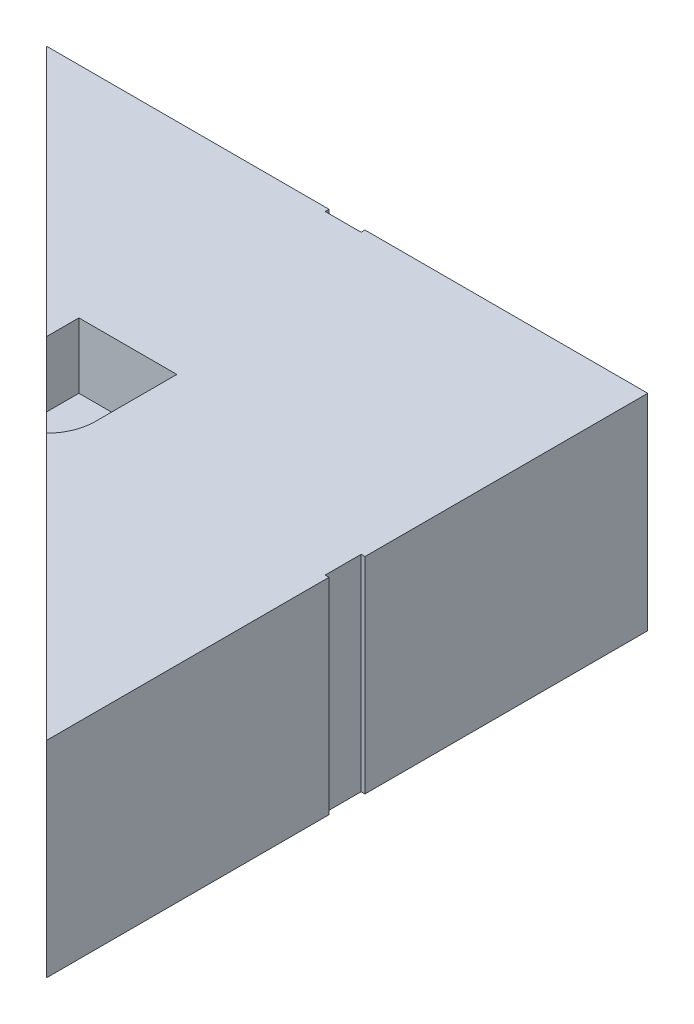
ISO-10303-21;
HEADER;
FILE_DESCRIPTION(('STEP AP214'),'2;1');
FILE_NAME('part.step','',(''),(''),'','','');
FILE_SCHEMA(('AUTOMOTIVE_DESIGN { 1 0 10303 214 1 1 1 1 }'));
ENDSEC;
DATA;
#1=APPLICATION_CONTEXT('core data for automotive mechanical design processes');
#2=APPLICATION_PROTOCOL_DEFINITION('international standard','automotive_design',2000,#1);
#3=PRODUCT_CONTEXT('',#1,'mechanical');
#4=PRODUCT('Part','Part','',(#3));
#5=PRODUCT_RELATED_PRODUCT_CATEGORY('part','',(#4));
#6=PRODUCT_DEFINITION_FORMATION('','',#4);
#7=PRODUCT_DEFINITION_CONTEXT('part definition',#1,'design');
#8=PRODUCT_DEFINITION('design','',#6,#7);
#9=PRODUCT_DEFINITION_SHAPE('','',#8);
#10=(LENGTH_UNIT() NAMED_UNIT(*) SI_UNIT(.MILLI.,.METRE.));
#11=(NAMED_UNIT(*) PLANE_ANGLE_UNIT() SI_UNIT($,.RADIAN.));
#12=(NAMED_UNIT(*) SI_UNIT($,.STERADIAN.) SOLID_ANGLE_UNIT());
#13=UNCERTAINTY_MEASURE_WITH_UNIT(LENGTH_MEASURE(1.E-05),#10,'distance_accuracy_value','');
#14=(GEOMETRIC_REPRESENTATION_CONTEXT(3) GLOBAL_UNCERTAINTY_ASSIGNED_CONTEXT((#13)) GLOBAL_UNIT_ASSIGNED_CONTEXT((#10,
#11,#12)) REPRESENTATION_CONTEXT('',''));
#15=CARTESIAN_POINT('',(0.,0.,0.));
#16=DIRECTION('',(0.,0.,1.));
#17=DIRECTION('',(1.,0.,0.));
#18=AXIS2_PLACEMENT_3D('',#15,#16,#17);
#19=CARTESIAN_POINT('',(117.,40.,0.));
#20=DIRECTION('',(-1.,0.,0.));
#21=DIRECTION('',(0.,0.,1.));
#22=AXIS2_PLACEMENT_3D('',#19,#20,#21);
#23=PLANE('',#22);
#24=DIRECTION('',(0.,0.,-1.));
#25=VECTOR('',#24,1.);
#26=CARTESIAN_POINT('',(117.,0.,0.));
#27=LINE('',#26,#25);
#28=CARTESIAN_POINT('',(117.,0.,0.));
#29=VERTEX_POINT('',#28);
#30=CARTESIAN_POINT('',(117.,0.,-54.9999999999998));
#31=VERTEX_POINT('',#30);
#32=EDGE_CURVE('E269',#29,#31,#27,.T.);
#33=ORIENTED_EDGE('',*,*,#32,.T.);
#34=DIRECTION('',(0.,1.,0.));
#35=VECTOR('',#34,1.);
#36=CARTESIAN_POINT('',(117.,40.,-54.9999999999998));
#37=LINE('',#36,#35);
#38=CARTESIAN_POINT('',(117.,40.,-54.9999999999998));
#39=VERTEX_POINT('',#38);
#40=EDGE_CURVE('E194',#31,#39,#37,.T.);
#41=ORIENTED_EDGE('',*,*,#40,.T.);
#42=DIRECTION('',(0.,0.,-1.));
#43=VECTOR('',#42,1.);
#44=CARTESIAN_POINT('',(117.,40.,0.));
#45=LINE('',#44,#43);
#46=CARTESIAN_POINT('',(117.,40.,0.));
#47=VERTEX_POINT('',#46);
#48=EDGE_CURVE('E169',#47,#39,#45,.T.);
#49=ORIENTED_EDGE('',*,*,#48,.F.);
#50=DIRECTION('',(0.,-1.,0.));
#51=VECTOR('',#50,1.);
#52=CARTESIAN_POINT('',(117.,40.,0.));
#53=LINE('',#52,#51);
#54=EDGE_CURVE('E178',#47,#29,#53,.T.);
#55=ORIENTED_EDGE('',*,*,#54,.T.);
#56=EDGE_LOOP('',(#33,#41,#49,#55));
#57=FACE_BOUND('',#56,.T.);
#58=ADVANCED_FACE('F36',(#57),#23,.F.);
#59=CARTESIAN_POINT('',(0.,40.,-117.));
#60=DIRECTION('',(0.,0.,1.));
#61=DIRECTION('',(1.,0.,0.));
#62=AXIS2_PLACEMENT_3D('',#59,#60,#61);
#63=PLANE('',#62);
#64=DIRECTION('',(-1.,0.,0.));
#65=VECTOR('',#64,1.);
#66=CARTESIAN_POINT('',(0.,0.,-117.));
#67=LINE('',#66,#65);
#68=CARTESIAN_POINT('',(117.,0.,-117.));
#69=VERTEX_POINT('',#68);
#70=CARTESIAN_POINT('',(62.,0.,-117.));
#71=VERTEX_POINT('',#70);
#72=EDGE_CURVE('E182',#69,#71,#67,.T.);
#73=ORIENTED_EDGE('',*,*,#72,.T.);
#74=DIRECTION('',(0.,1.,0.));
#75=VECTOR('',#74,1.);
#76=CARTESIAN_POINT('',(62.,40.,-117.));
#77=LINE('',#76,#75);
#78=CARTESIAN_POINT('',(62.,40.,-117.));
#79=VERTEX_POINT('',#78);
#80=EDGE_CURVE('E235',#71,#79,#77,.T.);
#81=ORIENTED_EDGE('',*,*,#80,.T.);
#82=DIRECTION('',(-1.,0.,0.));
#83=VECTOR('',#82,1.);
#84=CARTESIAN_POINT('',(0.,40.,-117.));
#85=LINE('',#84,#83);
#86=CARTESIAN_POINT('',(117.,40.,-117.));
#87=VERTEX_POINT('',#86);
#88=EDGE_CURVE('E168',#87,#79,#85,.T.);
#89=ORIENTED_EDGE('',*,*,#88,.F.);
#90=DIRECTION('',(0.,-1.,0.));
#91=VECTOR('',#90,1.);
#92=CARTESIAN_POINT('',(117.,40.,-117.));
#93=LINE('',#92,#91);
#94=EDGE_CURVE('E175',#87,#69,#93,.T.);
#95=ORIENTED_EDGE('',*,*,#94,.T.);
#96=EDGE_LOOP('',(#73,#81,#89,#95));
#97=FACE_BOUND('',#96,.T.);
#98=ADVANCED_FACE('F278',(#97),#63,.F.);
#99=CARTESIAN_POINT('',(117.,40.,-61.9999999999998));
#100=VERTEX_POINT('',#99);
#101=EDGE_CURVE('E268',#100,#87,#45,.T.);
#102=ORIENTED_EDGE('',*,*,#101,.F.);
#103=DIRECTION('',(0.,-1.,0.));
#104=VECTOR('',#103,1.);
#105=CARTESIAN_POINT('',(117.,40.,-61.9999999999998));
#106=LINE('',#105,#104);
#107=CARTESIAN_POINT('',(117.,0.,-61.9999999999998));
#108=VERTEX_POINT('',#107);
#109=EDGE_CURVE('E213',#100,#108,#106,.T.);
#110=ORIENTED_EDGE('',*,*,#109,.T.);
#111=EDGE_CURVE('E262',#108,#69,#27,.T.);
#112=ORIENTED_EDGE('',*,*,#111,.T.);
#113=ORIENTED_EDGE('',*,*,#94,.F.);
#114=EDGE_LOOP('',(#102,#110,#112,#113));
#115=FACE_BOUND('',#114,.T.);
#116=ADVANCED_FACE('F38',(#115),#23,.F.);
#117=CARTESIAN_POINT('',(55.,40.,-117.));
#118=VERTEX_POINT('',#117);
#119=CARTESIAN_POINT('',(0.,40.,-117.));
#120=VERTEX_POINT('',#119);
#121=EDGE_CURVE('E161',#118,#120,#85,.T.);
#122=ORIENTED_EDGE('',*,*,#121,.F.);
#123=DIRECTION('',(0.,-1.,0.));
#124=VECTOR('',#123,1.);
#125=CARTESIAN_POINT('',(55.,40.,-117.));
#126=LINE('',#125,#124);
#127=CARTESIAN_POINT('',(55.,0.,-117.));
#128=VERTEX_POINT('',#127);
#129=EDGE_CURVE('E232',#118,#128,#126,.T.);
#130=ORIENTED_EDGE('',*,*,#129,.T.);
#131=CARTESIAN_POINT('',(0.,0.,-117.));
#132=VERTEX_POINT('',#131);
#133=EDGE_CURVE('E174',#128,#132,#67,.T.);
#134=ORIENTED_EDGE('',*,*,#133,.T.);
#135=DIRECTION('',(0.,-1.,0.));
#136=VECTOR('',#135,1.);
#137=CARTESIAN_POINT('',(0.,40.,-117.));
#138=LINE('',#137,#136);
#139=EDGE_CURVE('E151',#120,#132,#138,.T.);
#140=ORIENTED_EDGE('',*,*,#139,.F.);
#141=EDGE_LOOP('',(#122,#130,#134,#140));
#142=FACE_BOUND('',#141,.T.);
#143=ADVANCED_FACE('F172',(#142),#63,.F.);
#144=CARTESIAN_POINT('',(0.,40.,0.));
#145=DIRECTION('',(0.,-1.,0.));
#146=DIRECTION('',(0.,0.,-1.));
#147=AXIS2_PLACEMENT_3D('',#144,#145,#146);
#148=PLANE('',#147);
#149=ORIENTED_EDGE('',*,*,#121,.T.);
#150=DIRECTION('',(0.707106781186548,0.,0.707106781186548));
#151=VECTOR('',#150,1.);
#152=CARTESIAN_POINT('',(0.,40.,-117.));
#153=LINE('',#152,#151);
#154=CARTESIAN_POINT('',(48.975,40.,-68.025));
#155=VERTEX_POINT('',#154);
#156=EDGE_CURVE('E147',#120,#155,#153,.T.);
#157=ORIENTED_EDGE('',*,*,#156,.T.);
#158=DIRECTION('',(0.,0.,-1.));
#159=VECTOR('',#158,1.);
#160=CARTESIAN_POINT('',(48.975,40.,0.));
#161=LINE('',#160,#159);
#162=CARTESIAN_POINT('',(48.975,40.,-74.375));
#163=VERTEX_POINT('',#162);
#164=EDGE_CURVE('E242',#155,#163,#161,.T.);
#165=ORIENTED_EDGE('',*,*,#164,.T.);
#166=DIRECTION('',(-1.,0.,0.));
#167=VECTOR('',#166,1.);
#168=CARTESIAN_POINT('',(0.,40.,-74.3750000000001));
#169=LINE('',#168,#167);
#170=CARTESIAN_POINT('',(68.025,40.,-74.375));
#171=VERTEX_POINT('',#170);
#172=EDGE_CURVE('E255',#171,#163,#169,.T.);
#173=ORIENTED_EDGE('',*,*,#172,.F.);
#174=DIRECTION('',(0.,0.,-1.));
#175=VECTOR('',#174,1.);
#176=CARTESIAN_POINT('',(68.025,40.,0.));
#177=LINE('',#176,#175);
#178=CARTESIAN_POINT('',(68.025,40.,-58.5));
#179=VERTEX_POINT('',#178);
#180=EDGE_CURVE('E252',#179,#171,#177,.T.);
#181=ORIENTED_EDGE('',*,*,#180,.F.);
#182=CARTESIAN_POINT('',(58.5,40.,-58.5));
#183=DIRECTION('',(0.,1.,0.));
#184=DIRECTION('',(0.,0.,1.));
#185=AXIS2_PLACEMENT_3D('',#182,#183,#184);
#186=CIRCLE('',#185,9.52500000000002);
#187=CARTESIAN_POINT('',(65.2351920908019,40.,-51.7648079091981));
#188=VERTEX_POINT('',#187);
#189=EDGE_CURVE('E238',#188,#179,#186,.T.);
#190=ORIENTED_EDGE('',*,*,#189,.F.);
#191=EDGE_CURVE('E157',#188,#47,#153,.T.);
#192=ORIENTED_EDGE('',*,*,#191,.T.);
#193=ORIENTED_EDGE('',*,*,#48,.T.);
#194=DIRECTION('',(-1.,0.,0.));
#195=VECTOR('',#194,1.);
#196=CARTESIAN_POINT('',(116.25,40.,-54.9999999999998));
#197=LINE('',#196,#195);
#198=CARTESIAN_POINT('',(116.25,40.,-54.9999999999998));
#199=VERTEX_POINT('',#198);
#200=EDGE_CURVE('E204',#39,#199,#197,.T.);
#201=ORIENTED_EDGE('',*,*,#200,.T.);
#202=DIRECTION('',(0.,0.,-1.));
#203=VECTOR('',#202,1.);
#204=CARTESIAN_POINT('',(116.25,40.,-61.9999999999998));
#205=LINE('',#204,#203);
#206=CARTESIAN_POINT('',(116.25,40.,-61.9999999999998));
#207=VERTEX_POINT('',#206);
#208=EDGE_CURVE('E285',#199,#207,#205,.T.);
#209=ORIENTED_EDGE('',*,*,#208,.T.);
#210=DIRECTION('',(1.,0.,0.));
#211=VECTOR('',#210,1.);
#212=CARTESIAN_POINT('',(116.25,40.,-61.9999999999998));
#213=LINE('',#212,#211);
#214=EDGE_CURVE('E208',#207,#100,#213,.T.);
#215=ORIENTED_EDGE('',*,*,#214,.T.);
#216=ORIENTED_EDGE('',*,*,#101,.T.);
#217=ORIENTED_EDGE('',*,*,#88,.T.);
#218=DIRECTION('',(0.,0.,1.));
#219=VECTOR('',#218,1.);
#220=CARTESIAN_POINT('',(62.,40.,-116.25));
#221=LINE('',#220,#219);
#222=CARTESIAN_POINT('',(62.,40.,-116.25));
#223=VERTEX_POINT('',#222);
#224=EDGE_CURVE('E219',#79,#223,#221,.T.);
#225=ORIENTED_EDGE('',*,*,#224,.T.);
#226=DIRECTION('',(-1.,0.,0.));
#227=VECTOR('',#226,1.);
#228=CARTESIAN_POINT('',(55.,40.,-116.25));
#229=LINE('',#228,#227);
#230=CARTESIAN_POINT('',(55.,40.,-116.25));
#231=VERTEX_POINT('',#230);
#232=EDGE_CURVE('E222',#223,#231,#229,.T.);
#233=ORIENTED_EDGE('',*,*,#232,.T.);
#234=DIRECTION('',(0.,0.,-1.));
#235=VECTOR('',#234,1.);
#236=CARTESIAN_POINT('',(55.,40.,-116.25));
#237=LINE('',#236,#235);
#238=EDGE_CURVE('E165',#231,#118,#237,.T.);
#239=ORIENTED_EDGE('',*,*,#238,.T.);
#240=EDGE_LOOP('',(#149,#157,#165,#173,#181,#190,#192,#193,#201,#209,#215,#216,#217,#225,#233,#239));
#241=FACE_BOUND('',#240,.T.);
#242=ADVANCED_FACE('F162',(#241),#148,.F.);
#243=CARTESIAN_POINT('',(0.,0.,0.));
#244=DIRECTION('',(0.,-1.,0.));
#245=DIRECTION('',(0.,0.,-1.));
#246=AXIS2_PLACEMENT_3D('',#243,#244,#245);
#247=PLANE('',#246);
#248=DIRECTION('',(0.707106781186548,0.,0.707106781186548));
#249=VECTOR('',#248,1.);
#250=CARTESIAN_POINT('',(0.,0.,-117.));
#251=LINE('',#250,#249);
#252=EDGE_CURVE('E290',#132,#29,#251,.T.);
#253=ORIENTED_EDGE('',*,*,#252,.F.);
#254=ORIENTED_EDGE('',*,*,#133,.F.);
#255=DIRECTION('',(0.,0.,-1.));
#256=VECTOR('',#255,1.);
#257=CARTESIAN_POINT('',(55.,0.,-116.25));
#258=LINE('',#257,#256);
#259=CARTESIAN_POINT('',(55.,0.,-116.25));
#260=VERTEX_POINT('',#259);
#261=EDGE_CURVE('E223',#260,#128,#258,.T.);
#262=ORIENTED_EDGE('',*,*,#261,.F.);
#263=DIRECTION('',(-1.,0.,0.));
#264=VECTOR('',#263,1.);
#265=CARTESIAN_POINT('',(55.,0.,-116.25));
#266=LINE('',#265,#264);
#267=CARTESIAN_POINT('',(62.,0.,-116.25));
#268=VERTEX_POINT('',#267);
#269=EDGE_CURVE('E218',#268,#260,#266,.T.);
#270=ORIENTED_EDGE('',*,*,#269,.F.);
#271=DIRECTION('',(0.,0.,1.));
#272=VECTOR('',#271,1.);
#273=CARTESIAN_POINT('',(62.,0.,0.));
#274=LINE('',#273,#272);
#275=EDGE_CURVE('E187',#71,#268,#274,.T.);
#276=ORIENTED_EDGE('',*,*,#275,.F.);
#277=ORIENTED_EDGE('',*,*,#72,.F.);
#278=ORIENTED_EDGE('',*,*,#111,.F.);
#279=DIRECTION('',(1.,0.,0.));
#280=VECTOR('',#279,1.);
#281=CARTESIAN_POINT('',(116.25,0.,-61.9999999999998));
#282=LINE('',#281,#280);
#283=CARTESIAN_POINT('',(116.25,0.,-61.9999999999998));
#284=VERTEX_POINT('',#283);
#285=EDGE_CURVE('E202',#284,#108,#282,.T.);
#286=ORIENTED_EDGE('',*,*,#285,.F.);
#287=DIRECTION('',(0.,0.,-1.));
#288=VECTOR('',#287,1.);
#289=CARTESIAN_POINT('',(116.25,0.,-61.9999999999998));
#290=LINE('',#289,#288);
#291=CARTESIAN_POINT('',(116.25,0.,-54.9999999999998));
#292=VERTEX_POINT('',#291);
#293=EDGE_CURVE('E199',#292,#284,#290,.T.);
#294=ORIENTED_EDGE('',*,*,#293,.F.);
#295=DIRECTION('',(-1.,0.,0.));
#296=VECTOR('',#295,1.);
#297=CARTESIAN_POINT('',(1.92031473636373E-13,0.,-55.0000000000002));
#298=LINE('',#297,#296);
#299=EDGE_CURVE('E44',#31,#292,#298,.T.);
#300=ORIENTED_EDGE('',*,*,#299,.F.);
#301=ORIENTED_EDGE('',*,*,#32,.F.);
#302=EDGE_LOOP('',(#253,#254,#262,#270,#276,#277,#278,#286,#294,#300,#301));
#303=FACE_BOUND('',#302,.T.);
#304=ADVANCED_FACE('F200',(#303),#247,.T.);
#305=CARTESIAN_POINT('',(48.975,27.3,0.));
#306=DIRECTION('',(1.,0.,0.));
#307=DIRECTION('',(0.,0.,-1.));
#308=AXIS2_PLACEMENT_3D('',#305,#306,#307);
#309=PLANE('',#308);
#310=DIRECTION('',(0.,1.,0.));
#311=VECTOR('',#310,1.);
#312=CARTESIAN_POINT('',(48.975,27.3,-68.025));
#313=LINE('',#312,#311);
#314=CARTESIAN_POINT('',(48.975,27.3,-68.025));
#315=VERTEX_POINT('',#314);
#316=EDGE_CURVE('E154',#315,#155,#313,.T.);
#317=ORIENTED_EDGE('',*,*,#316,.F.);
#318=DIRECTION('',(0.,0.,-1.));
#319=VECTOR('',#318,1.);
#320=CARTESIAN_POINT('',(48.975,27.3,0.));
#321=LINE('',#320,#319);
#322=CARTESIAN_POINT('',(48.975,27.3,-74.375));
#323=VERTEX_POINT('',#322);
#324=EDGE_CURVE('E248',#315,#323,#321,.T.);
#325=ORIENTED_EDGE('',*,*,#324,.T.);
#326=DIRECTION('',(0.,1.,0.));
#327=VECTOR('',#326,1.);
#328=CARTESIAN_POINT('',(48.975,27.3,-74.375));
#329=LINE('',#328,#327);
#330=EDGE_CURVE('E259',#323,#163,#329,.T.);
#331=ORIENTED_EDGE('',*,*,#330,.T.);
#332=ORIENTED_EDGE('',*,*,#164,.F.);
#333=EDGE_LOOP('',(#317,#325,#331,#332));
#334=FACE_BOUND('',#333,.T.);
#335=ADVANCED_FACE('F329',(#334),#309,.T.);
#336=CARTESIAN_POINT('',(0.,27.3,-74.3750000000001));
#337=DIRECTION('',(0.,0.,-1.));
#338=DIRECTION('',(-1.,0.,0.));
#339=AXIS2_PLACEMENT_3D('',#336,#337,#338);
#340=PLANE('',#339);
#341=ORIENTED_EDGE('',*,*,#172,.T.);
#342=ORIENTED_EDGE('',*,*,#330,.F.);
#343=DIRECTION('',(-1.,0.,0.));
#344=VECTOR('',#343,1.);
#345=CARTESIAN_POINT('',(0.,27.3,-74.3750000000001));
#346=LINE('',#345,#344);
#347=CARTESIAN_POINT('',(68.025,27.3,-74.375));
#348=VERTEX_POINT('',#347);
#349=EDGE_CURVE('E245',#348,#323,#346,.T.);
#350=ORIENTED_EDGE('',*,*,#349,.F.);
#351=DIRECTION('',(0.,1.,0.));
#352=VECTOR('',#351,1.);
#353=CARTESIAN_POINT('',(68.025,27.3,-74.375));
#354=LINE('',#353,#352);
#355=EDGE_CURVE('E263',#348,#171,#354,.T.);
#356=ORIENTED_EDGE('',*,*,#355,.T.);
#357=EDGE_LOOP('',(#341,#342,#350,#356));
#358=FACE_BOUND('',#357,.T.);
#359=ADVANCED_FACE('F337',(#358),#340,.F.);
#360=CARTESIAN_POINT('',(68.025,27.3,0.));
#361=DIRECTION('',(1.,0.,0.));
#362=DIRECTION('',(0.,0.,-1.));
#363=AXIS2_PLACEMENT_3D('',#360,#361,#362);
#364=PLANE('',#363);
#365=ORIENTED_EDGE('',*,*,#180,.T.);
#366=ORIENTED_EDGE('',*,*,#355,.F.);
#367=DIRECTION('',(0.,0.,-1.));
#368=VECTOR('',#367,1.);
#369=CARTESIAN_POINT('',(68.025,27.3,0.));
#370=LINE('',#369,#368);
#371=CARTESIAN_POINT('',(68.025,27.3,-58.5));
#372=VERTEX_POINT('',#371);
#373=EDGE_CURVE('E241',#372,#348,#370,.T.);
#374=ORIENTED_EDGE('',*,*,#373,.F.);
#375=DIRECTION('',(0.,1.,0.));
#376=VECTOR('',#375,1.);
#377=CARTESIAN_POINT('',(68.025,27.3,-58.5));
#378=LINE('',#377,#376);
#379=EDGE_CURVE('E250',#372,#179,#378,.T.);
#380=ORIENTED_EDGE('',*,*,#379,.T.);
#381=EDGE_LOOP('',(#365,#366,#374,#380));
#382=FACE_BOUND('',#381,.T.);
#383=ADVANCED_FACE('F333',(#382),#364,.F.);
#384=CARTESIAN_POINT('',(58.5,27.3,-58.5));
#385=DIRECTION('',(0.,1.,0.));
#386=DIRECTION('',(0.,0.,1.));
#387=AXIS2_PLACEMENT_3D('',#384,#385,#386);
#388=CYLINDRICAL_SURFACE('',#387,9.52500000000002);
#389=CARTESIAN_POINT('',(58.5,27.3,-58.5));
#390=DIRECTION('',(0.,1.,0.));
#391=DIRECTION('',(0.,0.,1.));
#392=AXIS2_PLACEMENT_3D('',#389,#390,#391);
#393=CIRCLE('',#392,9.52500000000002);
#394=CARTESIAN_POINT('',(65.2351920908019,27.3,-51.7648079091981));
#395=VERTEX_POINT('',#394);
#396=EDGE_CURVE('E239',#395,#372,#393,.T.);
#397=ORIENTED_EDGE('',*,*,#396,.F.);
#398=DIRECTION('',(0.,1.,0.));
#399=VECTOR('',#398,1.);
#400=CARTESIAN_POINT('',(65.2351920908019,27.3,-51.7648079091981));
#401=LINE('',#400,#399);
#402=EDGE_CURVE('E50',#395,#188,#401,.T.);
#403=ORIENTED_EDGE('',*,*,#402,.T.);
#404=ORIENTED_EDGE('',*,*,#189,.T.);
#405=ORIENTED_EDGE('',*,*,#379,.F.);
#406=EDGE_LOOP('',(#397,#403,#404,#405));
#407=FACE_BOUND('',#406,.T.);
#408=ADVANCED_FACE('F311',(#407),#388,.F.);
#409=CARTESIAN_POINT('',(0.,27.3,0.));
#410=DIRECTION('',(0.,1.,0.));
#411=DIRECTION('',(0.,0.,1.));
#412=AXIS2_PLACEMENT_3D('',#409,#410,#411);
#413=PLANE('',#412);
#414=DIRECTION('',(-0.707106781186548,0.,-0.707106781186548));
#415=VECTOR('',#414,1.);
#416=CARTESIAN_POINT('',(58.5,27.3,-58.5));
#417=LINE('',#416,#415);
#418=EDGE_CURVE('E11',#395,#315,#417,.T.);
#419=ORIENTED_EDGE('',*,*,#418,.F.);
#420=ORIENTED_EDGE('',*,*,#396,.T.);
#421=ORIENTED_EDGE('',*,*,#373,.T.);
#422=ORIENTED_EDGE('',*,*,#349,.T.);
#423=ORIENTED_EDGE('',*,*,#324,.F.);
#424=EDGE_LOOP('',(#419,#420,#421,#422,#423));
#425=FACE_BOUND('',#424,.T.);
#426=ADVANCED_FACE('F304',(#425),#413,.T.);
#427=CARTESIAN_POINT('',(62.,40.,-116.25));
#428=DIRECTION('',(1.,0.,0.));
#429=DIRECTION('',(0.,0.,-1.));
#430=AXIS2_PLACEMENT_3D('',#427,#428,#429);
#431=PLANE('',#430);
#432=ORIENTED_EDGE('',*,*,#275,.T.);
#433=DIRECTION('',(0.,-1.,0.));
#434=VECTOR('',#433,1.);
#435=CARTESIAN_POINT('',(62.,40.,-116.25));
#436=LINE('',#435,#434);
#437=EDGE_CURVE('E226',#223,#268,#436,.T.);
#438=ORIENTED_EDGE('',*,*,#437,.F.);
#439=ORIENTED_EDGE('',*,*,#224,.F.);
#440=ORIENTED_EDGE('',*,*,#80,.F.);
#441=EDGE_LOOP('',(#432,#438,#439,#440));
#442=FACE_BOUND('',#441,.T.);
#443=ADVANCED_FACE('F302',(#442),#431,.F.);
#444=CARTESIAN_POINT('',(55.,40.,-116.25));
#445=DIRECTION('',(-1.,0.,0.));
#446=DIRECTION('',(0.,0.,1.));
#447=AXIS2_PLACEMENT_3D('',#444,#445,#446);
#448=PLANE('',#447);
#449=ORIENTED_EDGE('',*,*,#238,.F.);
#450=DIRECTION('',(0.,-1.,0.));
#451=VECTOR('',#450,1.);
#452=CARTESIAN_POINT('',(55.,40.,-116.25));
#453=LINE('',#452,#451);
#454=EDGE_CURVE('E230',#231,#260,#453,.T.);
#455=ORIENTED_EDGE('',*,*,#454,.T.);
#456=ORIENTED_EDGE('',*,*,#261,.T.);
#457=ORIENTED_EDGE('',*,*,#129,.F.);
#458=EDGE_LOOP('',(#449,#455,#456,#457));
#459=FACE_BOUND('',#458,.T.);
#460=ADVANCED_FACE('F297',(#459),#448,.F.);
#461=CARTESIAN_POINT('',(55.,40.,-116.25));
#462=DIRECTION('',(0.,0.,1.));
#463=DIRECTION('',(1.,0.,0.));
#464=AXIS2_PLACEMENT_3D('',#461,#462,#463);
#465=PLANE('',#464);
#466=ORIENTED_EDGE('',*,*,#269,.T.);
#467=ORIENTED_EDGE('',*,*,#454,.F.);
#468=ORIENTED_EDGE('',*,*,#232,.F.);
#469=ORIENTED_EDGE('',*,*,#437,.T.);
#470=EDGE_LOOP('',(#466,#467,#468,#469));
#471=FACE_BOUND('',#470,.T.);
#472=ADVANCED_FACE('F300',(#471),#465,.F.);
#473=CARTESIAN_POINT('',(116.25,40.,-54.9999999999998));
#474=DIRECTION('',(0.,0.,1.));
#475=DIRECTION('',(1.,0.,0.));
#476=AXIS2_PLACEMENT_3D('',#473,#474,#475);
#477=PLANE('',#476);
#478=ORIENTED_EDGE('',*,*,#299,.T.);
#479=DIRECTION('',(0.,-1.,0.));
#480=VECTOR('',#479,1.);
#481=CARTESIAN_POINT('',(116.25,40.,-54.9999999999998));
#482=LINE('',#481,#480);
#483=EDGE_CURVE('E58',#199,#292,#482,.T.);
#484=ORIENTED_EDGE('',*,*,#483,.F.);
#485=ORIENTED_EDGE('',*,*,#200,.F.);
#486=ORIENTED_EDGE('',*,*,#40,.F.);
#487=EDGE_LOOP('',(#478,#484,#485,#486));
#488=FACE_BOUND('',#487,.T.);
#489=ADVANCED_FACE('F192',(#488),#477,.F.);
#490=CARTESIAN_POINT('',(116.25,40.,-61.9999999999998));
#491=DIRECTION('',(0.,0.,-1.));
#492=DIRECTION('',(-1.,0.,0.));
#493=AXIS2_PLACEMENT_3D('',#490,#491,#492);
#494=PLANE('',#493);
#495=ORIENTED_EDGE('',*,*,#214,.F.);
#496=DIRECTION('',(0.,-1.,0.));
#497=VECTOR('',#496,1.);
#498=CARTESIAN_POINT('',(116.25,40.,-61.9999999999998));
#499=LINE('',#498,#497);
#500=EDGE_CURVE('E211',#207,#284,#499,.T.);
#501=ORIENTED_EDGE('',*,*,#500,.T.);
#502=ORIENTED_EDGE('',*,*,#285,.T.);
#503=ORIENTED_EDGE('',*,*,#109,.F.);
#504=EDGE_LOOP('',(#495,#501,#502,#503));
#505=FACE_BOUND('',#504,.T.);
#506=ADVANCED_FACE('F392',(#505),#494,.F.);
#507=CARTESIAN_POINT('',(116.25,40.,-61.9999999999998));
#508=DIRECTION('',(-1.,0.,0.));
#509=DIRECTION('',(0.,0.,1.));
#510=AXIS2_PLACEMENT_3D('',#507,#508,#509);
#511=PLANE('',#510);
#512=ORIENTED_EDGE('',*,*,#293,.T.);
#513=ORIENTED_EDGE('',*,*,#500,.F.);
#514=ORIENTED_EDGE('',*,*,#208,.F.);
#515=ORIENTED_EDGE('',*,*,#483,.T.);
#516=EDGE_LOOP('',(#512,#513,#514,#515));
#517=FACE_BOUND('',#516,.T.);
#518=ADVANCED_FACE('F382',(#517),#511,.F.);
#519=CARTESIAN_POINT('',(0.,40.,-117.));
#520=DIRECTION('',(0.707106781186548,0.,-0.707106781186548));
#521=DIRECTION('',(-0.707106781186548,0.,-0.707106781186548));
#522=AXIS2_PLACEMENT_3D('',#519,#520,#521);
#523=PLANE('',#522);
#524=ORIENTED_EDGE('',*,*,#316,.T.);
#525=ORIENTED_EDGE('',*,*,#156,.F.);
#526=ORIENTED_EDGE('',*,*,#139,.T.);
#527=ORIENTED_EDGE('',*,*,#252,.T.);
#528=ORIENTED_EDGE('',*,*,#54,.F.);
#529=ORIENTED_EDGE('',*,*,#191,.F.);
#530=ORIENTED_EDGE('',*,*,#402,.F.);
#531=ORIENTED_EDGE('',*,*,#418,.T.);
#532=EDGE_LOOP('',(#524,#525,#526,#527,#528,#529,#530,#531));
#533=FACE_BOUND('',#532,.T.);
#534=ADVANCED_FACE('F149',(#533),#523,.F.);
#535=CLOSED_SHELL('',(#58,#98,#116,#143,#242,#304,#335,#359,#383,#408,#426,#443,#460,#472,#489,
#506,#518,#534));
#536=MANIFOLD_SOLID_BREP('B2',#535);
#537=ADVANCED_BREP_SHAPE_REPRESENTATION('',(#18,#536),#14);
#538=SHAPE_DEFINITION_REPRESENTATION(#9,#537);
ENDSEC;
END-ISO-10303-21;
